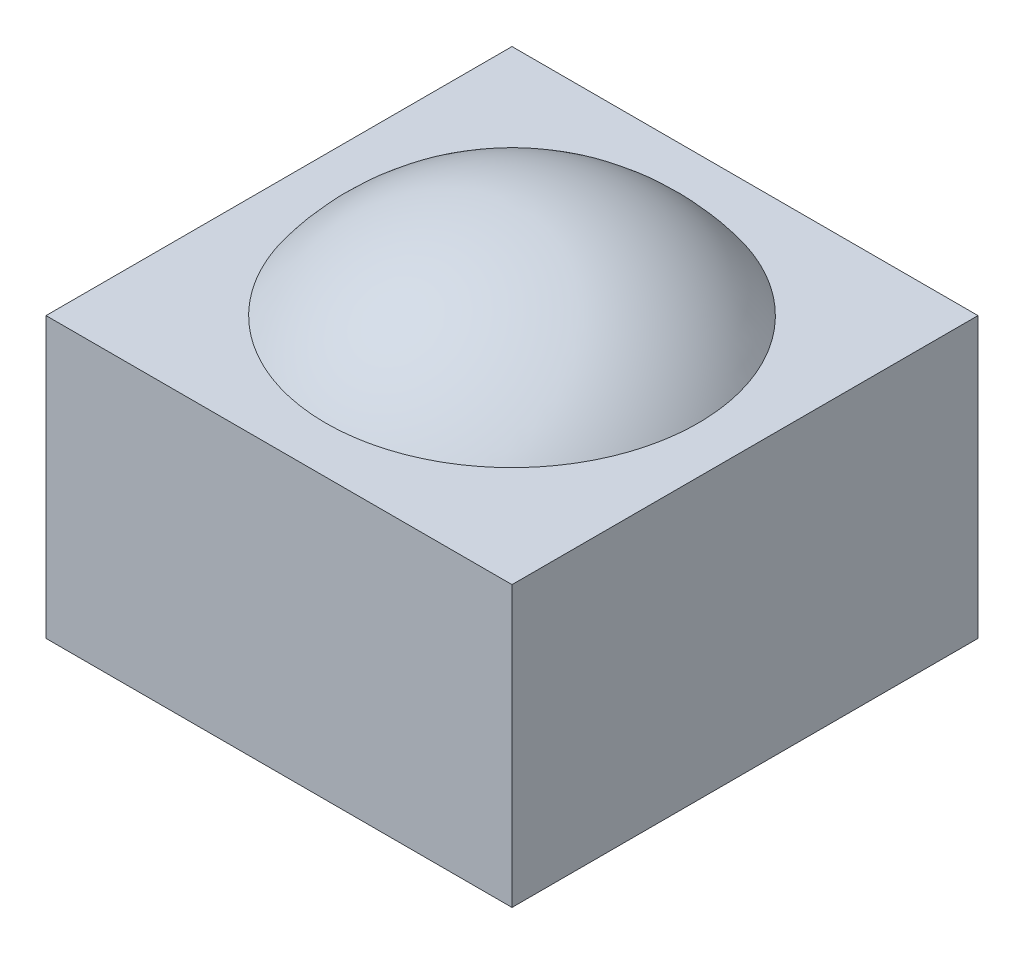
ISO-10303-21;
HEADER;
FILE_DESCRIPTION(('STEP AP214'),'2;1');
FILE_NAME('part.step','',(''),(''),'','','');
FILE_SCHEMA(('AUTOMOTIVE_DESIGN { 1 0 10303 214 1 1 1 1 }'));
ENDSEC;
DATA;
#1=APPLICATION_CONTEXT('core data for automotive mechanical design processes');
#2=APPLICATION_PROTOCOL_DEFINITION('international standard','automotive_design',2000,#1);
#3=PRODUCT_CONTEXT('',#1,'mechanical');
#4=PRODUCT('Part','Part','',(#3));
#5=PRODUCT_RELATED_PRODUCT_CATEGORY('part','',(#4));
#6=PRODUCT_DEFINITION_FORMATION('','',#4);
#7=PRODUCT_DEFINITION_CONTEXT('part definition',#1,'design');
#8=PRODUCT_DEFINITION('design','',#6,#7);
#9=PRODUCT_DEFINITION_SHAPE('','',#8);
#10=(LENGTH_UNIT() NAMED_UNIT(*) SI_UNIT(.MILLI.,.METRE.));
#11=(NAMED_UNIT(*) PLANE_ANGLE_UNIT() SI_UNIT($,.RADIAN.));
#12=(NAMED_UNIT(*) SI_UNIT($,.STERADIAN.) SOLID_ANGLE_UNIT());
#13=UNCERTAINTY_MEASURE_WITH_UNIT(LENGTH_MEASURE(1.E-05),#10,'distance_accuracy_value','');
#14=(GEOMETRIC_REPRESENTATION_CONTEXT(3) GLOBAL_UNCERTAINTY_ASSIGNED_CONTEXT((#13)) GLOBAL_UNIT_ASSIGNED_CONTEXT((#10,
#11,#12)) REPRESENTATION_CONTEXT('',''));
#15=CARTESIAN_POINT('',(0.,0.,0.));
#16=DIRECTION('',(0.,0.,1.));
#17=DIRECTION('',(1.,0.,0.));
#18=AXIS2_PLACEMENT_3D('',#15,#16,#17);
#19=CARTESIAN_POINT('',(-25.,15.,25.));
#20=DIRECTION('',(1.,0.,0.));
#21=DIRECTION('',(0.,0.,-1.));
#22=AXIS2_PLACEMENT_3D('',#19,#20,#21);
#23=PLANE('',#22);
#24=DIRECTION('',(0.,0.,1.));
#25=VECTOR('',#24,1.);
#26=CARTESIAN_POINT('',(-25.,-15.,25.));
#27=LINE('',#26,#25);
#28=CARTESIAN_POINT('',(-25.,-15.,-25.));
#29=VERTEX_POINT('',#28);
#30=CARTESIAN_POINT('',(-25.,-15.,25.));
#31=VERTEX_POINT('',#30);
#32=EDGE_CURVE('E108',#29,#31,#27,.T.);
#33=ORIENTED_EDGE('',*,*,#32,.T.);
#34=DIRECTION('',(0.,-1.,0.));
#35=VECTOR('',#34,1.);
#36=CARTESIAN_POINT('',(-25.,15.,25.));
#37=LINE('',#36,#35);
#38=CARTESIAN_POINT('',(-25.,15.,25.));
#39=VERTEX_POINT('',#38);
#40=EDGE_CURVE('E12',#39,#31,#37,.T.);
#41=ORIENTED_EDGE('',*,*,#40,.F.);
#42=DIRECTION('',(0.,0.,1.));
#43=VECTOR('',#42,1.);
#44=CARTESIAN_POINT('',(-25.,15.,25.));
#45=LINE('',#44,#43);
#46=CARTESIAN_POINT('',(-25.,15.,-25.));
#47=VERTEX_POINT('',#46);
#48=EDGE_CURVE('E96',#47,#39,#45,.T.);
#49=ORIENTED_EDGE('',*,*,#48,.F.);
#50=DIRECTION('',(0.,-1.,0.));
#51=VECTOR('',#50,1.);
#52=CARTESIAN_POINT('',(-25.,15.,-25.));
#53=LINE('',#52,#51);
#54=EDGE_CURVE('E104',#47,#29,#53,.T.);
#55=ORIENTED_EDGE('',*,*,#54,.T.);
#56=EDGE_LOOP('',(#33,#41,#49,#55));
#57=FACE_BOUND('',#56,.T.);
#58=ADVANCED_FACE('F45',(#57),#23,.F.);
#59=CARTESIAN_POINT('',(25.,15.,25.));
#60=DIRECTION('',(0.,0.,-1.));
#61=DIRECTION('',(-1.,0.,0.));
#62=AXIS2_PLACEMENT_3D('',#59,#60,#61);
#63=PLANE('',#62);
#64=DIRECTION('',(1.,0.,0.));
#65=VECTOR('',#64,1.);
#66=CARTESIAN_POINT('',(25.,-15.,25.));
#67=LINE('',#66,#65);
#68=CARTESIAN_POINT('',(25.,-15.,25.));
#69=VERTEX_POINT('',#68);
#70=EDGE_CURVE('E100',#31,#69,#67,.T.);
#71=ORIENTED_EDGE('',*,*,#70,.T.);
#72=DIRECTION('',(0.,-1.,0.));
#73=VECTOR('',#72,1.);
#74=CARTESIAN_POINT('',(25.,15.,25.));
#75=LINE('',#74,#73);
#76=CARTESIAN_POINT('',(25.,15.,25.));
#77=VERTEX_POINT('',#76);
#78=EDGE_CURVE('E53',#77,#69,#75,.T.);
#79=ORIENTED_EDGE('',*,*,#78,.F.);
#80=DIRECTION('',(1.,0.,0.));
#81=VECTOR('',#80,1.);
#82=CARTESIAN_POINT('',(25.,15.,25.));
#83=LINE('',#82,#81);
#84=EDGE_CURVE('E91',#39,#77,#83,.T.);
#85=ORIENTED_EDGE('',*,*,#84,.F.);
#86=ORIENTED_EDGE('',*,*,#40,.T.);
#87=EDGE_LOOP('',(#71,#79,#85,#86));
#88=FACE_BOUND('',#87,.T.);
#89=ADVANCED_FACE('F99',(#88),#63,.F.);
#90=CARTESIAN_POINT('',(25.,15.,25.));
#91=DIRECTION('',(-1.,0.,0.));
#92=DIRECTION('',(0.,0.,1.));
#93=AXIS2_PLACEMENT_3D('',#90,#91,#92);
#94=PLANE('',#93);
#95=DIRECTION('',(0.,0.,-1.));
#96=VECTOR('',#95,1.);
#97=CARTESIAN_POINT('',(25.,-15.,25.));
#98=LINE('',#97,#96);
#99=CARTESIAN_POINT('',(25.,-15.,-25.));
#100=VERTEX_POINT('',#99);
#101=EDGE_CURVE('E78',#69,#100,#98,.T.);
#102=ORIENTED_EDGE('',*,*,#101,.T.);
#103=DIRECTION('',(0.,-1.,0.));
#104=VECTOR('',#103,1.);
#105=CARTESIAN_POINT('',(25.,15.,-25.));
#106=LINE('',#105,#104);
#107=CARTESIAN_POINT('',(25.,15.,-25.));
#108=VERTEX_POINT('',#107);
#109=EDGE_CURVE('E101',#108,#100,#106,.T.);
#110=ORIENTED_EDGE('',*,*,#109,.F.);
#111=DIRECTION('',(0.,0.,-1.));
#112=VECTOR('',#111,1.);
#113=CARTESIAN_POINT('',(25.,15.,25.));
#114=LINE('',#113,#112);
#115=EDGE_CURVE('E94',#77,#108,#114,.T.);
#116=ORIENTED_EDGE('',*,*,#115,.F.);
#117=ORIENTED_EDGE('',*,*,#78,.T.);
#118=EDGE_LOOP('',(#102,#110,#116,#117));
#119=FACE_BOUND('',#118,.T.);
#120=ADVANCED_FACE('F102',(#119),#94,.F.);
#121=CARTESIAN_POINT('',(25.,15.,-25.));
#122=DIRECTION('',(0.,0.,1.));
#123=DIRECTION('',(1.,0.,0.));
#124=AXIS2_PLACEMENT_3D('',#121,#122,#123);
#125=PLANE('',#124);
#126=DIRECTION('',(-1.,0.,0.));
#127=VECTOR('',#126,1.);
#128=CARTESIAN_POINT('',(25.,-15.,-25.));
#129=LINE('',#128,#127);
#130=EDGE_CURVE('E84',#100,#29,#129,.T.);
#131=ORIENTED_EDGE('',*,*,#130,.T.);
#132=ORIENTED_EDGE('',*,*,#54,.F.);
#133=DIRECTION('',(-1.,0.,0.));
#134=VECTOR('',#133,1.);
#135=CARTESIAN_POINT('',(25.,15.,-25.));
#136=LINE('',#135,#134);
#137=EDGE_CURVE('E61',#108,#47,#136,.T.);
#138=ORIENTED_EDGE('',*,*,#137,.F.);
#139=ORIENTED_EDGE('',*,*,#109,.T.);
#140=EDGE_LOOP('',(#131,#132,#138,#139));
#141=FACE_BOUND('',#140,.T.);
#142=ADVANCED_FACE('F115',(#141),#125,.F.);
#143=CARTESIAN_POINT('',(0.,15.,0.));
#144=DIRECTION('',(0.,1.,0.));
#145=DIRECTION('',(0.,0.,1.));
#146=AXIS2_PLACEMENT_3D('',#143,#144,#145);
#147=PLANE('',#146);
#148=ORIENTED_EDGE('',*,*,#48,.T.);
#149=ORIENTED_EDGE('',*,*,#84,.T.);
#150=ORIENTED_EDGE('',*,*,#115,.T.);
#151=ORIENTED_EDGE('',*,*,#137,.T.);
#152=EDGE_LOOP('',(#148,#149,#150,#151));
#153=FACE_BOUND('',#152,.T.);
#154=ADVANCED_FACE('F92',(#153),#147,.T.);
#155=CARTESIAN_POINT('',(0.,-15.,0.));
#156=DIRECTION('',(0.,1.,0.));
#157=DIRECTION('',(0.,0.,1.));
#158=AXIS2_PLACEMENT_3D('',#155,#156,#157);
#159=PLANE('',#158);
#160=ORIENTED_EDGE('',*,*,#32,.F.);
#161=ORIENTED_EDGE('',*,*,#130,.F.);
#162=ORIENTED_EDGE('',*,*,#101,.F.);
#163=ORIENTED_EDGE('',*,*,#70,.F.);
#164=EDGE_LOOP('',(#160,#161,#162,#163));
#165=FACE_BOUND('',#164,.T.);
#166=ADVANCED_FACE('F118',(#165),#159,.F.);
#167=CLOSED_SHELL('',(#58,#89,#120,#142,#154,#166));
#168=MANIFOLD_SOLID_BREP('B2_NOT_SHOWN',#167);
#169=CARTESIAN_POINT('',(0.,0.,0.));
#170=DIRECTION('',(0.,-1.,0.));
#171=DIRECTION('',(-1.,0.,0.));
#172=AXIS2_PLACEMENT_3D('',#169,#170,#171);
#173=SPHERICAL_SURFACE('',#172,25.);
#174=CARTESIAN_POINT('',(0.,-25.,0.));
#175=VERTEX_POINT('',#174);
#176=VERTEX_LOOP('',#175);
#177=FACE_BOUND('',#176,.T.);
#178=ADVANCED_FACE('F181',(#177),#173,.T.);
#179=CLOSED_SHELL('',(#178));
#180=MANIFOLD_SOLID_BREP('B6',#179);
#181=ADVANCED_BREP_SHAPE_REPRESENTATION('',(#18,#168,#180),#14);
#182=SHAPE_DEFINITION_REPRESENTATION(#9,#181);
ENDSEC;
END-ISO-10303-21;
